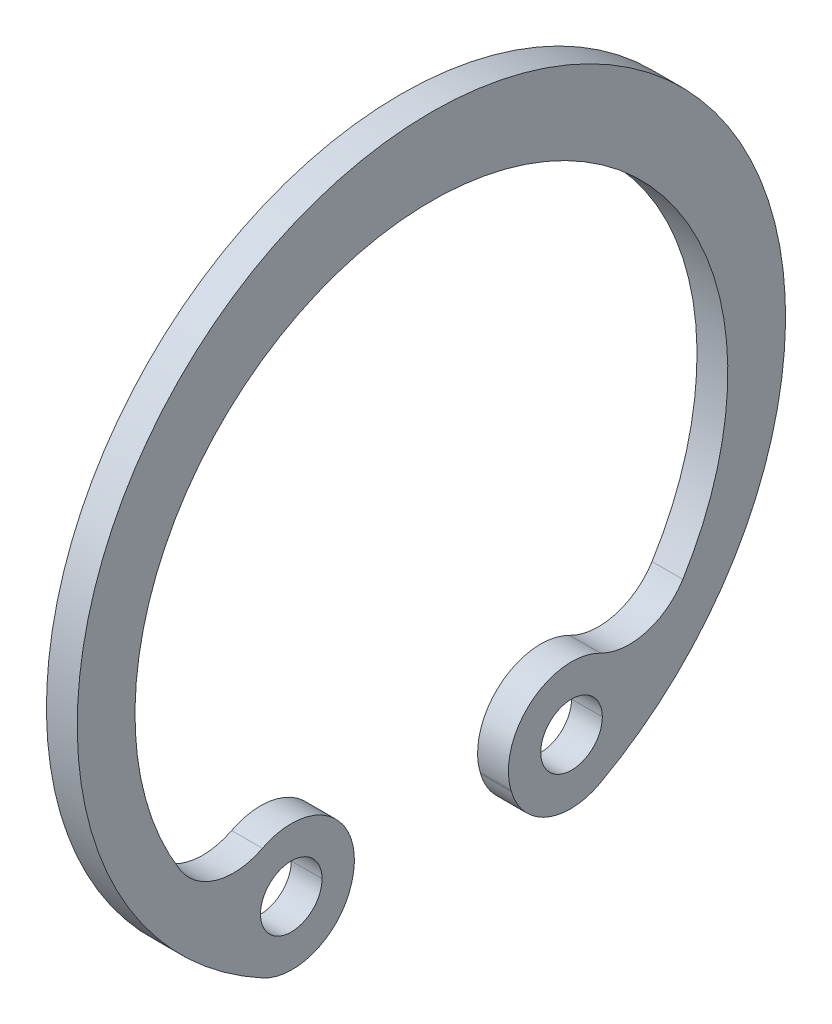
ISO-10303-21;
HEADER;
FILE_DESCRIPTION(('STEP AP214'),'2;1');
FILE_NAME('part.step','',(''),(''),'','','');
FILE_SCHEMA(('AUTOMOTIVE_DESIGN { 1 0 10303 214 1 1 1 1 }'));
ENDSEC;
DATA;
#1=APPLICATION_CONTEXT('core data for automotive mechanical design processes');
#2=APPLICATION_PROTOCOL_DEFINITION('international standard','automotive_design',2000,#1);
#3=PRODUCT_CONTEXT('',#1,'mechanical');
#4=PRODUCT('Part','Part','',(#3));
#5=PRODUCT_RELATED_PRODUCT_CATEGORY('part','',(#4));
#6=PRODUCT_DEFINITION_FORMATION('','',#4);
#7=PRODUCT_DEFINITION_CONTEXT('part definition',#1,'design');
#8=PRODUCT_DEFINITION('design','',#6,#7);
#9=PRODUCT_DEFINITION_SHAPE('','',#8);
#10=(LENGTH_UNIT() NAMED_UNIT(*) SI_UNIT(.MILLI.,.METRE.));
#11=(NAMED_UNIT(*) PLANE_ANGLE_UNIT() SI_UNIT($,.RADIAN.));
#12=(NAMED_UNIT(*) SI_UNIT($,.STERADIAN.) SOLID_ANGLE_UNIT());
#13=UNCERTAINTY_MEASURE_WITH_UNIT(LENGTH_MEASURE(1.E-05),#10,'distance_accuracy_value','');
#14=(GEOMETRIC_REPRESENTATION_CONTEXT(3) GLOBAL_UNCERTAINTY_ASSIGNED_CONTEXT((#13)) GLOBAL_UNIT_ASSIGNED_CONTEXT((#10,
#11,#12)) REPRESENTATION_CONTEXT('',''));
#15=CARTESIAN_POINT('',(0.,0.,0.));
#16=DIRECTION('',(0.,0.,1.));
#17=DIRECTION('',(1.,0.,0.));
#18=AXIS2_PLACEMENT_3D('',#15,#16,#17);
#19=CARTESIAN_POINT('',(0.5,-8.35614485396469,-4.51938526567201));
#20=DIRECTION('',(-1.,0.,0.));
#21=DIRECTION('',(0.,0.922739691980155,-0.385423741931357));
#22=AXIS2_PLACEMENT_3D('',#19,#20,#21);
#23=CYLINDRICAL_SURFACE('',#22,1.99999999999884);
#24=CARTESIAN_POINT('',(-0.5,-8.35614485396469,-4.51938526567201));
#25=DIRECTION('',(1.,0.,0.));
#26=DIRECTION('',(0.,0.,-1.));
#27=AXIS2_PLACEMENT_3D('',#24,#25,#26);
#28=CIRCLE('',#27,1.99999999999884);
#29=CARTESIAN_POINT('',(-0.5,-8.9159152274564,-2.5993183061739));
#30=VERTEX_POINT('',#29);
#31=CARTESIAN_POINT('',(-0.5,-10.115333244271,-5.4708347952882));
#32=VERTEX_POINT('',#31);
#33=EDGE_CURVE('E11',#30,#32,#28,.T.);
#34=ORIENTED_EDGE('',*,*,#33,.T.);
#35=DIRECTION('',(-1.,0.,0.));
#36=VECTOR('',#35,1.);
#37=CARTESIAN_POINT('',(0.5,-10.115333244271,-5.4708347952882));
#38=LINE('',#37,#36);
#39=CARTESIAN_POINT('',(0.5,-10.115333244271,-5.4708347952882));
#40=VERTEX_POINT('',#39);
#41=EDGE_CURVE('E24',#40,#32,#38,.T.);
#42=ORIENTED_EDGE('',*,*,#41,.F.);
#43=CARTESIAN_POINT('',(0.5,-8.35614485396469,-4.51938526567201));
#44=DIRECTION('',(1.,0.,0.));
#45=DIRECTION('',(0.,0.,-1.));
#46=AXIS2_PLACEMENT_3D('',#43,#44,#45);
#47=CIRCLE('',#46,1.99999999999884);
#48=CARTESIAN_POINT('',(0.5,-8.9159152274564,-2.5993183061739));
#49=VERTEX_POINT('',#48);
#50=EDGE_CURVE('E300',#49,#40,#47,.T.);
#51=ORIENTED_EDGE('',*,*,#50,.F.);
#52=DIRECTION('',(-1.,0.,0.));
#53=VECTOR('',#52,1.);
#54=CARTESIAN_POINT('',(0.5,-8.9159152274564,-2.5993183061739));
#55=LINE('',#54,#53);
#56=EDGE_CURVE('E296',#49,#30,#55,.T.);
#57=ORIENTED_EDGE('',*,*,#56,.T.);
#58=EDGE_LOOP('',(#34,#42,#51,#57));
#59=FACE_BOUND('',#58,.T.);
#60=ADVANCED_FACE('F16',(#59),#23,.T.);
#61=CARTESIAN_POINT('',(0.5,-8.8562763291698,-2.5819313665136));
#62=DIRECTION('',(0.,0.279885186746055,-0.9600334797496));
#63=DIRECTION('',(0.,0.9600334797496,0.279885186746055));
#64=AXIS2_PLACEMENT_3D('',#61,#62,#63);
#65=PLANE('',#64);
#66=DIRECTION('',(0.,-0.9600334797496,-0.279885186746055));
#67=VECTOR('',#66,1.);
#68=CARTESIAN_POINT('',(-0.5,-8.8562763291698,-2.5819313665136));
#69=LINE('',#68,#67);
#70=CARTESIAN_POINT('',(-0.5,-8.8562763291698,-2.5819313665136));
#71=VERTEX_POINT('',#70);
#72=EDGE_CURVE('E291',#71,#30,#69,.T.);
#73=ORIENTED_EDGE('',*,*,#72,.T.);
#74=ORIENTED_EDGE('',*,*,#56,.F.);
#75=DIRECTION('',(0.,-0.9600334797496,-0.279885186746055));
#76=VECTOR('',#75,1.);
#77=CARTESIAN_POINT('',(0.5,-8.8562763291698,-2.5819313665136));
#78=LINE('',#77,#76);
#79=CARTESIAN_POINT('',(0.5,-8.8562763291698,-2.5819313665136));
#80=VERTEX_POINT('',#79);
#81=EDGE_CURVE('E286',#80,#49,#78,.T.);
#82=ORIENTED_EDGE('',*,*,#81,.F.);
#83=DIRECTION('',(-1.,0.,0.));
#84=VECTOR('',#83,1.);
#85=CARTESIAN_POINT('',(0.5,-8.8562763291698,-2.5819313665136));
#86=LINE('',#85,#84);
#87=EDGE_CURVE('E282',#80,#71,#86,.T.);
#88=ORIENTED_EDGE('',*,*,#87,.T.);
#89=EDGE_LOOP('',(#73,#74,#82,#88));
#90=FACE_BOUND('',#89,.T.);
#91=ADVANCED_FACE('F317',(#90),#65,.F.);
#92=CARTESIAN_POINT('',(0.5,-8.28251169633942,-4.55));
#93=DIRECTION('',(-1.,0.,0.));
#94=DIRECTION('',(0.,-0.771452706473191,-0.636286666271727));
#95=AXIS2_PLACEMENT_3D('',#92,#93,#94);
#96=CYLINDRICAL_SURFACE('',#95,2.04999999999997);
#97=CARTESIAN_POINT('',(-0.5,-8.28251169633942,-4.55));
#98=DIRECTION('',(1.,0.,0.));
#99=DIRECTION('',(0.,0.,-1.));
#100=AXIS2_PLACEMENT_3D('',#97,#98,#99);
#101=CIRCLE('',#100,2.04999999999997);
#102=CARTESIAN_POINT('',(-0.5,-6.4595744916504,-5.4877632685067));
#103=VERTEX_POINT('',#102);
#104=EDGE_CURVE('E277',#103,#71,#101,.T.);
#105=ORIENTED_EDGE('',*,*,#104,.T.);
#106=ORIENTED_EDGE('',*,*,#87,.F.);
#107=CARTESIAN_POINT('',(0.5,-8.28251169633942,-4.55));
#108=DIRECTION('',(1.,0.,0.));
#109=DIRECTION('',(0.,0.,-1.));
#110=AXIS2_PLACEMENT_3D('',#107,#108,#109);
#111=CIRCLE('',#110,2.04999999999997);
#112=CARTESIAN_POINT('',(0.5,-6.4595744916504,-5.4877632685067));
#113=VERTEX_POINT('',#112);
#114=EDGE_CURVE('E272',#113,#80,#111,.T.);
#115=ORIENTED_EDGE('',*,*,#114,.F.);
#116=DIRECTION('',(-1.,0.,0.));
#117=VECTOR('',#116,1.);
#118=CARTESIAN_POINT('',(0.5,-6.4595744916504,-5.4877632685067));
#119=LINE('',#118,#117);
#120=EDGE_CURVE('E268',#113,#103,#119,.T.);
#121=ORIENTED_EDGE('',*,*,#120,.T.);
#122=EDGE_LOOP('',(#105,#106,#115,#121));
#123=FACE_BOUND('',#122,.T.);
#124=ADVANCED_FACE('F349',(#123),#96,.T.);
#125=CARTESIAN_POINT('',(0.5,-4.63663728696139,-6.42552653701331));
#126=DIRECTION('',(-1.,0.,0.));
#127=DIRECTION('',(0.,0.964095608375025,0.265555376356778));
#128=AXIS2_PLACEMENT_3D('',#125,#126,#127);
#129=CYLINDRICAL_SURFACE('',#128,2.0499999999999);
#130=CARTESIAN_POINT('',(-0.5,-4.63663728696139,-6.42552653701331));
#131=DIRECTION('',(1.,0.,0.));
#132=DIRECTION('',(0.,0.,-1.));
#133=AXIS2_PLACEMENT_3D('',#130,#131,#132);
#134=CIRCLE('',#133,2.0499999999999);
#135=CARTESIAN_POINT('',(-0.5,-5.7222949025745,-8.1644479100664));
#136=VERTEX_POINT('',#135);
#137=EDGE_CURVE('E263',#103,#136,#134,.T.);
#138=ORIENTED_EDGE('',*,*,#137,.F.);
#139=ORIENTED_EDGE('',*,*,#120,.F.);
#140=CARTESIAN_POINT('',(0.5,-4.63663728696139,-6.42552653701331));
#141=DIRECTION('',(1.,0.,0.));
#142=DIRECTION('',(0.,0.,-1.));
#143=AXIS2_PLACEMENT_3D('',#140,#141,#142);
#144=CIRCLE('',#143,2.0499999999999);
#145=CARTESIAN_POINT('',(0.5,-5.7222949025745,-8.1644479100664));
#146=VERTEX_POINT('',#145);
#147=EDGE_CURVE('E259',#113,#146,#144,.T.);
#148=ORIENTED_EDGE('',*,*,#147,.T.);
#149=DIRECTION('',(-1.,0.,0.));
#150=VECTOR('',#149,1.);
#151=CARTESIAN_POINT('',(0.5,-5.7222949025745,-8.1644479100664));
#152=LINE('',#151,#150);
#153=EDGE_CURVE('E255',#146,#136,#152,.T.);
#154=ORIENTED_EDGE('',*,*,#153,.T.);
#155=EDGE_LOOP('',(#138,#139,#148,#154));
#156=FACE_BOUND('',#155,.T.);
#157=ADVANCED_FACE('F346',(#156),#129,.F.);
#158=CARTESIAN_POINT('',(0.5,-0.624999999999986,0.));
#159=DIRECTION('',(-1.,0.,0.));
#160=DIRECTION('',(0.,-1.,0.));
#161=AXIS2_PLACEMENT_3D('',#158,#159,#160);
#162=CYLINDRICAL_SURFACE('',#161,9.625);
#163=CARTESIAN_POINT('',(-0.5,-0.624999999999986,0.));
#164=DIRECTION('',(1.,0.,0.));
#165=DIRECTION('',(0.,0.,-1.));
#166=AXIS2_PLACEMENT_3D('',#163,#164,#165);
#167=CIRCLE('',#166,9.625);
#168=CARTESIAN_POINT('',(-0.5,-5.7222949025745,8.1644479100664));
#169=VERTEX_POINT('',#168);
#170=EDGE_CURVE('E250',#136,#169,#167,.T.);
#171=ORIENTED_EDGE('',*,*,#170,.F.);
#172=ORIENTED_EDGE('',*,*,#153,.F.);
#173=CARTESIAN_POINT('',(0.5,-0.624999999999986,0.));
#174=DIRECTION('',(1.,0.,0.));
#175=DIRECTION('',(0.,0.,-1.));
#176=AXIS2_PLACEMENT_3D('',#173,#174,#175);
#177=CIRCLE('',#176,9.625);
#178=CARTESIAN_POINT('',(0.5,-5.7222949025745,8.1644479100664));
#179=VERTEX_POINT('',#178);
#180=EDGE_CURVE('E246',#146,#179,#177,.T.);
#181=ORIENTED_EDGE('',*,*,#180,.T.);
#182=DIRECTION('',(-1.,0.,0.));
#183=VECTOR('',#182,1.);
#184=CARTESIAN_POINT('',(0.5,-5.7222949025745,8.1644479100664));
#185=LINE('',#184,#183);
#186=EDGE_CURVE('E242',#179,#169,#185,.T.);
#187=ORIENTED_EDGE('',*,*,#186,.T.);
#188=EDGE_LOOP('',(#171,#172,#181,#187));
#189=FACE_BOUND('',#188,.T.);
#190=ADVANCED_FACE('F343',(#189),#162,.F.);
#191=CARTESIAN_POINT('',(0.5,-4.63663728696139,6.42552653701331));
#192=DIRECTION('',(-1.,0.,0.));
#193=DIRECTION('',(0.,0.964095608375026,-0.265555376356777));
#194=AXIS2_PLACEMENT_3D('',#191,#192,#193);
#195=CYLINDRICAL_SURFACE('',#194,2.0499999999999);
#196=CARTESIAN_POINT('',(-0.5,-4.63663728696139,6.42552653701331));
#197=DIRECTION('',(1.,0.,0.));
#198=DIRECTION('',(0.,0.,-1.));
#199=AXIS2_PLACEMENT_3D('',#196,#197,#198);
#200=CIRCLE('',#199,2.0499999999999);
#201=CARTESIAN_POINT('',(-0.5,-6.4595744916504,5.4877632685067));
#202=VERTEX_POINT('',#201);
#203=EDGE_CURVE('E237',#169,#202,#200,.T.);
#204=ORIENTED_EDGE('',*,*,#203,.F.);
#205=ORIENTED_EDGE('',*,*,#186,.F.);
#206=CARTESIAN_POINT('',(0.5,-4.63663728696139,6.42552653701331));
#207=DIRECTION('',(1.,0.,0.));
#208=DIRECTION('',(0.,0.,-1.));
#209=AXIS2_PLACEMENT_3D('',#206,#207,#208);
#210=CIRCLE('',#209,2.0499999999999);
#211=CARTESIAN_POINT('',(0.5,-6.4595744916504,5.4877632685067));
#212=VERTEX_POINT('',#211);
#213=EDGE_CURVE('E233',#179,#212,#210,.T.);
#214=ORIENTED_EDGE('',*,*,#213,.T.);
#215=DIRECTION('',(-1.,0.,0.));
#216=VECTOR('',#215,1.);
#217=CARTESIAN_POINT('',(0.5,-6.4595744916504,5.4877632685067));
#218=LINE('',#217,#216);
#219=EDGE_CURVE('E229',#212,#202,#218,.T.);
#220=ORIENTED_EDGE('',*,*,#219,.T.);
#221=EDGE_LOOP('',(#204,#205,#214,#220));
#222=FACE_BOUND('',#221,.T.);
#223=ADVANCED_FACE('F336',(#222),#195,.F.);
#224=CARTESIAN_POINT('',(0.5,-8.28251169633942,4.55));
#225=DIRECTION('',(-1.,0.,0.));
#226=DIRECTION('',(0.,-0.771452706473191,0.636286666271728));
#227=AXIS2_PLACEMENT_3D('',#224,#225,#226);
#228=CYLINDRICAL_SURFACE('',#227,2.04999999999997);
#229=CARTESIAN_POINT('',(-0.5,-8.28251169633942,4.55));
#230=DIRECTION('',(1.,0.,0.));
#231=DIRECTION('',(0.,0.,-1.));
#232=AXIS2_PLACEMENT_3D('',#229,#230,#231);
#233=CIRCLE('',#232,2.04999999999997);
#234=CARTESIAN_POINT('',(-0.5,-8.8562763291698,2.5819313665136));
#235=VERTEX_POINT('',#234);
#236=EDGE_CURVE('E224',#235,#202,#233,.T.);
#237=ORIENTED_EDGE('',*,*,#236,.T.);
#238=ORIENTED_EDGE('',*,*,#219,.F.);
#239=CARTESIAN_POINT('',(0.5,-8.28251169633942,4.55));
#240=DIRECTION('',(1.,0.,0.));
#241=DIRECTION('',(0.,0.,-1.));
#242=AXIS2_PLACEMENT_3D('',#239,#240,#241);
#243=CIRCLE('',#242,2.04999999999997);
#244=CARTESIAN_POINT('',(0.5,-8.8562763291698,2.5819313665136));
#245=VERTEX_POINT('',#244);
#246=EDGE_CURVE('E219',#245,#212,#243,.T.);
#247=ORIENTED_EDGE('',*,*,#246,.F.);
#248=DIRECTION('',(-1.,0.,0.));
#249=VECTOR('',#248,1.);
#250=CARTESIAN_POINT('',(0.5,-8.8562763291698,2.5819313665136));
#251=LINE('',#250,#249);
#252=EDGE_CURVE('E215',#245,#235,#251,.T.);
#253=ORIENTED_EDGE('',*,*,#252,.T.);
#254=EDGE_LOOP('',(#237,#238,#247,#253));
#255=FACE_BOUND('',#254,.T.);
#256=ADVANCED_FACE('F333',(#255),#228,.T.);
#257=CARTESIAN_POINT('',(0.5,-8.9159152274564,2.5993183061739));
#258=DIRECTION('',(0.,0.279885186746055,0.9600334797496));
#259=DIRECTION('',(0.,-0.9600334797496,0.279885186746055));
#260=AXIS2_PLACEMENT_3D('',#257,#258,#259);
#261=PLANE('',#260);
#262=DIRECTION('',(0.,0.9600334797496,-0.279885186746055));
#263=VECTOR('',#262,1.);
#264=CARTESIAN_POINT('',(-0.5,-8.9159152274564,2.5993183061739));
#265=LINE('',#264,#263);
#266=CARTESIAN_POINT('',(-0.5,-8.9159152274564,2.5993183061739));
#267=VERTEX_POINT('',#266);
#268=EDGE_CURVE('E210',#267,#235,#265,.T.);
#269=ORIENTED_EDGE('',*,*,#268,.T.);
#270=ORIENTED_EDGE('',*,*,#252,.F.);
#271=DIRECTION('',(0.,0.9600334797496,-0.279885186746055));
#272=VECTOR('',#271,1.);
#273=CARTESIAN_POINT('',(0.5,-8.9159152274564,2.5993183061739));
#274=LINE('',#273,#272);
#275=CARTESIAN_POINT('',(0.5,-8.9159152274564,2.5993183061739));
#276=VERTEX_POINT('',#275);
#277=EDGE_CURVE('E205',#276,#245,#274,.T.);
#278=ORIENTED_EDGE('',*,*,#277,.F.);
#279=DIRECTION('',(-1.,0.,0.));
#280=VECTOR('',#279,1.);
#281=CARTESIAN_POINT('',(0.5,-8.9159152274564,2.5993183061739));
#282=LINE('',#281,#280);
#283=EDGE_CURVE('E201',#276,#267,#282,.T.);
#284=ORIENTED_EDGE('',*,*,#283,.T.);
#285=EDGE_LOOP('',(#269,#270,#278,#284));
#286=FACE_BOUND('',#285,.T.);
#287=ADVANCED_FACE('F331',(#286),#261,.F.);
#288=CARTESIAN_POINT('',(0.5,-8.3561448539647,4.51938526567201));
#289=DIRECTION('',(-1.,0.,0.));
#290=DIRECTION('',(0.,0.922739691980155,0.385423741931357));
#291=AXIS2_PLACEMENT_3D('',#288,#289,#290);
#292=CYLINDRICAL_SURFACE('',#291,1.99999999999884);
#293=CARTESIAN_POINT('',(-0.5,-8.3561448539647,4.51938526567201));
#294=DIRECTION('',(1.,0.,0.));
#295=DIRECTION('',(0.,0.,-1.));
#296=AXIS2_PLACEMENT_3D('',#293,#294,#295);
#297=CIRCLE('',#296,1.99999999999884);
#298=CARTESIAN_POINT('',(-0.5,-10.115333244271,5.47083479528821));
#299=VERTEX_POINT('',#298);
#300=EDGE_CURVE('E196',#299,#267,#297,.T.);
#301=ORIENTED_EDGE('',*,*,#300,.T.);
#302=ORIENTED_EDGE('',*,*,#283,.F.);
#303=CARTESIAN_POINT('',(0.5,-8.3561448539647,4.51938526567201));
#304=DIRECTION('',(1.,0.,0.));
#305=DIRECTION('',(0.,0.,-1.));
#306=AXIS2_PLACEMENT_3D('',#303,#304,#305);
#307=CIRCLE('',#306,1.99999999999884);
#308=CARTESIAN_POINT('',(0.5,-10.115333244271,5.47083479528821));
#309=VERTEX_POINT('',#308);
#310=EDGE_CURVE('E191',#309,#276,#307,.T.);
#311=ORIENTED_EDGE('',*,*,#310,.F.);
#312=DIRECTION('',(-1.,0.,0.));
#313=VECTOR('',#312,1.);
#314=CARTESIAN_POINT('',(0.5,-10.115333244271,5.47083479528821));
#315=LINE('',#314,#313);
#316=EDGE_CURVE('E187',#309,#299,#315,.T.);
#317=ORIENTED_EDGE('',*,*,#316,.T.);
#318=EDGE_LOOP('',(#301,#302,#311,#317));
#319=FACE_BOUND('',#318,.T.);
#320=ADVANCED_FACE('F326',(#319),#292,.T.);
#321=CARTESIAN_POINT('',(0.5,2.27682456221956E-13,0.));
#322=DIRECTION('',(-1.,0.,0.));
#323=DIRECTION('',(0.,-1.,0.));
#324=AXIS2_PLACEMENT_3D('',#321,#322,#323);
#325=CYLINDRICAL_SURFACE('',#324,11.4999999999998);
#326=CARTESIAN_POINT('',(-0.5,2.27682456221956E-13,0.));
#327=DIRECTION('',(1.,0.,0.));
#328=DIRECTION('',(0.,0.,-1.));
#329=AXIS2_PLACEMENT_3D('',#326,#327,#328);
#330=CIRCLE('',#329,11.4999999999998);
#331=EDGE_CURVE('E182',#32,#299,#330,.T.);
#332=ORIENTED_EDGE('',*,*,#331,.T.);
#333=ORIENTED_EDGE('',*,*,#316,.F.);
#334=CARTESIAN_POINT('',(0.5,2.27682456221956E-13,0.));
#335=DIRECTION('',(1.,0.,0.));
#336=DIRECTION('',(0.,0.,-1.));
#337=AXIS2_PLACEMENT_3D('',#334,#335,#336);
#338=CIRCLE('',#337,11.4999999999998);
#339=EDGE_CURVE('E177',#40,#309,#338,.T.);
#340=ORIENTED_EDGE('',*,*,#339,.F.);
#341=ORIENTED_EDGE('',*,*,#41,.T.);
#342=EDGE_LOOP('',(#332,#333,#340,#341));
#343=FACE_BOUND('',#342,.T.);
#344=ADVANCED_FACE('F310',(#343),#325,.T.);
#345=CARTESIAN_POINT('',(0.5,-8.35614485396469,-4.51938526567201));
#346=DIRECTION('',(1.,0.,0.));
#347=DIRECTION('',(0.,0.,-1.));
#348=AXIS2_PLACEMENT_3D('',#345,#346,#347);
#349=PLANE('',#348);
#350=CARTESIAN_POINT('',(0.5,-8.2825116963395,4.55));
#351=DIRECTION('',(1.,0.,0.));
#352=DIRECTION('',(0.,0.,-1.));
#353=AXIS2_PLACEMENT_3D('',#350,#351,#352);
#354=CIRCLE('',#353,1.);
#355=CARTESIAN_POINT('',(0.5,-8.2825116963395,5.55));
#356=VERTEX_POINT('',#355);
#357=CARTESIAN_POINT('',(0.5,-8.2825116963395,3.55));
#358=VERTEX_POINT('',#357);
#359=EDGE_CURVE('E133',#356,#358,#354,.T.);
#360=ORIENTED_EDGE('',*,*,#359,.F.);
#361=CARTESIAN_POINT('',(0.5,-8.2825116963395,4.55));
#362=DIRECTION('',(1.,0.,0.));
#363=DIRECTION('',(0.,0.,-1.));
#364=AXIS2_PLACEMENT_3D('',#361,#362,#363);
#365=CIRCLE('',#364,1.);
#366=EDGE_CURVE('E170',#358,#356,#365,.T.);
#367=ORIENTED_EDGE('',*,*,#366,.F.);
#368=EDGE_LOOP('',(#360,#367));
#369=FACE_BOUND('',#368,.T.);
#370=CARTESIAN_POINT('',(0.5,-8.2825116963395,-4.55));
#371=DIRECTION('',(1.,0.,0.));
#372=DIRECTION('',(0.,0.,-1.));
#373=AXIS2_PLACEMENT_3D('',#370,#371,#372);
#374=CIRCLE('',#373,1.);
#375=CARTESIAN_POINT('',(0.5,-8.2825116963395,-3.55));
#376=VERTEX_POINT('',#375);
#377=CARTESIAN_POINT('',(0.5,-8.2825116963395,-5.55));
#378=VERTEX_POINT('',#377);
#379=EDGE_CURVE('E165',#376,#378,#374,.T.);
#380=ORIENTED_EDGE('',*,*,#379,.F.);
#381=CARTESIAN_POINT('',(0.5,-8.2825116963395,-4.55));
#382=DIRECTION('',(1.,0.,0.));
#383=DIRECTION('',(0.,0.,-1.));
#384=AXIS2_PLACEMENT_3D('',#381,#382,#383);
#385=CIRCLE('',#384,1.);
#386=EDGE_CURVE('E160',#378,#376,#385,.T.);
#387=ORIENTED_EDGE('',*,*,#386,.F.);
#388=EDGE_LOOP('',(#380,#387));
#389=FACE_BOUND('',#388,.T.);
#390=ORIENTED_EDGE('',*,*,#50,.T.);
#391=ORIENTED_EDGE('',*,*,#339,.T.);
#392=ORIENTED_EDGE('',*,*,#310,.T.);
#393=ORIENTED_EDGE('',*,*,#277,.T.);
#394=ORIENTED_EDGE('',*,*,#246,.T.);
#395=ORIENTED_EDGE('',*,*,#213,.F.);
#396=ORIENTED_EDGE('',*,*,#180,.F.);
#397=ORIENTED_EDGE('',*,*,#147,.F.);
#398=ORIENTED_EDGE('',*,*,#114,.T.);
#399=ORIENTED_EDGE('',*,*,#81,.T.);
#400=EDGE_LOOP('',(#390,#391,#392,#393,#394,#395,#396,#397,#398,#399));
#401=FACE_BOUND('',#400,.T.);
#402=ADVANCED_FACE('F314',(#369,#389,#401),#349,.T.);
#403=CARTESIAN_POINT('',(0.5,-8.2825116963395,-4.55));
#404=DIRECTION('',(-1.,0.,0.));
#405=DIRECTION('',(0.,-1.,0.));
#406=AXIS2_PLACEMENT_3D('',#403,#404,#405);
#407=CYLINDRICAL_SURFACE('',#406,1.);
#408=DIRECTION('',(-1.,0.,0.));
#409=VECTOR('',#408,1.);
#410=CARTESIAN_POINT('',(0.5,-8.2825116963395,-5.55));
#411=LINE('',#410,#409);
#412=CARTESIAN_POINT('',(-0.5,-8.2825116963395,-5.55));
#413=VERTEX_POINT('',#412);
#414=EDGE_CURVE('E155',#378,#413,#411,.T.);
#415=ORIENTED_EDGE('',*,*,#414,.F.);
#416=ORIENTED_EDGE('',*,*,#386,.T.);
#417=DIRECTION('',(-1.,0.,0.));
#418=VECTOR('',#417,1.);
#419=CARTESIAN_POINT('',(0.5,-8.2825116963395,-3.55));
#420=LINE('',#419,#418);
#421=CARTESIAN_POINT('',(-0.5,-8.2825116963395,-3.55));
#422=VERTEX_POINT('',#421);
#423=EDGE_CURVE('E151',#376,#422,#420,.T.);
#424=ORIENTED_EDGE('',*,*,#423,.T.);
#425=CARTESIAN_POINT('',(-0.5,-8.2825116963395,-4.55));
#426=DIRECTION('',(1.,0.,0.));
#427=DIRECTION('',(0.,0.,-1.));
#428=AXIS2_PLACEMENT_3D('',#425,#426,#427);
#429=CIRCLE('',#428,1.);
#430=EDGE_CURVE('E130',#413,#422,#429,.T.);
#431=ORIENTED_EDGE('',*,*,#430,.F.);
#432=EDGE_LOOP('',(#415,#416,#424,#431));
#433=FACE_BOUND('',#432,.T.);
#434=ADVANCED_FACE('F447',(#433),#407,.F.);
#435=CARTESIAN_POINT('',(-0.5,-8.35614485396469,-4.51938526567201));
#436=DIRECTION('',(1.,0.,0.));
#437=DIRECTION('',(0.,0.,-1.));
#438=AXIS2_PLACEMENT_3D('',#435,#436,#437);
#439=PLANE('',#438);
#440=CARTESIAN_POINT('',(-0.5,-8.2825116963395,4.55));
#441=DIRECTION('',(1.,0.,0.));
#442=DIRECTION('',(0.,0.,-1.));
#443=AXIS2_PLACEMENT_3D('',#440,#441,#442);
#444=CIRCLE('',#443,1.);
#445=CARTESIAN_POINT('',(-0.5,-8.2825116963395,3.55));
#446=VERTEX_POINT('',#445);
#447=CARTESIAN_POINT('',(-0.5,-8.2825116963395,5.55));
#448=VERTEX_POINT('',#447);
#449=EDGE_CURVE('E116',#446,#448,#444,.T.);
#450=ORIENTED_EDGE('',*,*,#449,.T.);
#451=CARTESIAN_POINT('',(-0.5,-8.2825116963395,4.55));
#452=DIRECTION('',(1.,0.,0.));
#453=DIRECTION('',(0.,0.,-1.));
#454=AXIS2_PLACEMENT_3D('',#451,#452,#453);
#455=CIRCLE('',#454,1.);
#456=EDGE_CURVE('E112',#448,#446,#455,.T.);
#457=ORIENTED_EDGE('',*,*,#456,.T.);
#458=EDGE_LOOP('',(#450,#457));
#459=FACE_BOUND('',#458,.T.);
#460=ORIENTED_EDGE('',*,*,#430,.T.);
#461=CARTESIAN_POINT('',(-0.5,-8.2825116963395,-4.55));
#462=DIRECTION('',(1.,0.,0.));
#463=DIRECTION('',(0.,0.,-1.));
#464=AXIS2_PLACEMENT_3D('',#461,#462,#463);
#465=CIRCLE('',#464,1.);
#466=EDGE_CURVE('E121',#422,#413,#465,.T.);
#467=ORIENTED_EDGE('',*,*,#466,.T.);
#468=EDGE_LOOP('',(#460,#467));
#469=FACE_BOUND('',#468,.T.);
#470=ORIENTED_EDGE('',*,*,#33,.F.);
#471=ORIENTED_EDGE('',*,*,#72,.F.);
#472=ORIENTED_EDGE('',*,*,#104,.F.);
#473=ORIENTED_EDGE('',*,*,#137,.T.);
#474=ORIENTED_EDGE('',*,*,#170,.T.);
#475=ORIENTED_EDGE('',*,*,#203,.T.);
#476=ORIENTED_EDGE('',*,*,#236,.F.);
#477=ORIENTED_EDGE('',*,*,#268,.F.);
#478=ORIENTED_EDGE('',*,*,#300,.F.);
#479=ORIENTED_EDGE('',*,*,#331,.F.);
#480=EDGE_LOOP('',(#470,#471,#472,#473,#474,#475,#476,#477,#478,#479));
#481=FACE_BOUND('',#480,.T.);
#482=ADVANCED_FACE('F114',(#459,#469,#481),#439,.F.);
#483=CARTESIAN_POINT('',(0.5,-8.2825116963395,-4.55));
#484=DIRECTION('',(-1.,0.,0.));
#485=DIRECTION('',(0.,1.,0.));
#486=AXIS2_PLACEMENT_3D('',#483,#484,#485);
#487=CYLINDRICAL_SURFACE('',#486,1.);
#488=ORIENTED_EDGE('',*,*,#414,.T.);
#489=ORIENTED_EDGE('',*,*,#466,.F.);
#490=ORIENTED_EDGE('',*,*,#423,.F.);
#491=ORIENTED_EDGE('',*,*,#379,.T.);
#492=EDGE_LOOP('',(#488,#489,#490,#491));
#493=FACE_BOUND('',#492,.T.);
#494=ADVANCED_FACE('F468',(#493),#487,.F.);
#495=CARTESIAN_POINT('',(0.5,-8.2825116963395,4.55));
#496=DIRECTION('',(-1.,0.,0.));
#497=DIRECTION('',(0.,1.,0.));
#498=AXIS2_PLACEMENT_3D('',#495,#496,#497);
#499=CYLINDRICAL_SURFACE('',#498,1.);
#500=DIRECTION('',(-1.,0.,0.));
#501=VECTOR('',#500,1.);
#502=CARTESIAN_POINT('',(0.5,-8.2825116963395,3.55));
#503=LINE('',#502,#501);
#504=EDGE_CURVE('E127',#358,#446,#503,.T.);
#505=ORIENTED_EDGE('',*,*,#504,.T.);
#506=ORIENTED_EDGE('',*,*,#456,.F.);
#507=DIRECTION('',(-1.,0.,0.));
#508=VECTOR('',#507,1.);
#509=CARTESIAN_POINT('',(0.5,-8.2825116963395,5.55));
#510=LINE('',#509,#508);
#511=EDGE_CURVE('E129',#356,#448,#510,.T.);
#512=ORIENTED_EDGE('',*,*,#511,.F.);
#513=ORIENTED_EDGE('',*,*,#359,.T.);
#514=EDGE_LOOP('',(#505,#506,#512,#513));
#515=FACE_BOUND('',#514,.T.);
#516=ADVANCED_FACE('F132',(#515),#499,.F.);
#517=CARTESIAN_POINT('',(0.5,-8.2825116963395,4.55));
#518=DIRECTION('',(-1.,0.,0.));
#519=DIRECTION('',(0.,-1.,0.));
#520=AXIS2_PLACEMENT_3D('',#517,#518,#519);
#521=CYLINDRICAL_SURFACE('',#520,1.);
#522=ORIENTED_EDGE('',*,*,#504,.F.);
#523=ORIENTED_EDGE('',*,*,#366,.T.);
#524=ORIENTED_EDGE('',*,*,#511,.T.);
#525=ORIENTED_EDGE('',*,*,#449,.F.);
#526=EDGE_LOOP('',(#522,#523,#524,#525));
#527=FACE_BOUND('',#526,.T.);
#528=ADVANCED_FACE('F125',(#527),#521,.F.);
#529=CLOSED_SHELL('',(#60,#91,#124,#157,#190,#223,#256,#287,#320,#344,#402,#434,#482,#494,#516,#528));
#530=MANIFOLD_SOLID_BREP('B1',#529);
#531=ADVANCED_BREP_SHAPE_REPRESENTATION('',(#18,#530),#14);
#532=SHAPE_DEFINITION_REPRESENTATION(#9,#531);
ENDSEC;
END-ISO-10303-21;
